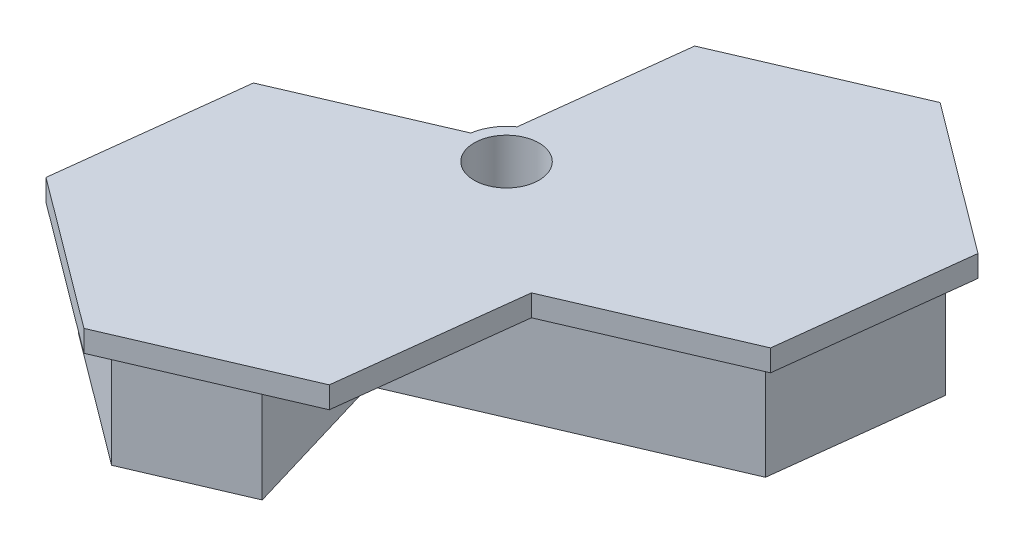
ISO-10303-21;
HEADER;
FILE_DESCRIPTION(('STEP AP214'),'2;1');
FILE_NAME('part.step','',(''),(''),'','','');
FILE_SCHEMA(('AUTOMOTIVE_DESIGN { 1 0 10303 214 1 1 1 1 }'));
ENDSEC;
DATA;
#1=APPLICATION_CONTEXT('core data for automotive mechanical design processes');
#2=APPLICATION_PROTOCOL_DEFINITION('international standard','automotive_design',2000,#1);
#3=PRODUCT_CONTEXT('',#1,'mechanical');
#4=PRODUCT('Part','Part','',(#3));
#5=PRODUCT_RELATED_PRODUCT_CATEGORY('part','',(#4));
#6=PRODUCT_DEFINITION_FORMATION('','',#4);
#7=PRODUCT_DEFINITION_CONTEXT('part definition',#1,'design');
#8=PRODUCT_DEFINITION('design','',#6,#7);
#9=PRODUCT_DEFINITION_SHAPE('','',#8);
#10=(LENGTH_UNIT() NAMED_UNIT(*) SI_UNIT(.MILLI.,.METRE.));
#11=(NAMED_UNIT(*) PLANE_ANGLE_UNIT() SI_UNIT($,.RADIAN.));
#12=(NAMED_UNIT(*) SI_UNIT($,.STERADIAN.) SOLID_ANGLE_UNIT());
#13=UNCERTAINTY_MEASURE_WITH_UNIT(LENGTH_MEASURE(1.E-05),#10,'distance_accuracy_value','');
#14=(GEOMETRIC_REPRESENTATION_CONTEXT(3) GLOBAL_UNCERTAINTY_ASSIGNED_CONTEXT((#13)) GLOBAL_UNIT_ASSIGNED_CONTEXT((#10,
#11,#12)) REPRESENTATION_CONTEXT('',''));
#15=CARTESIAN_POINT('',(0.,0.,0.));
#16=DIRECTION('',(0.,0.,1.));
#17=DIRECTION('',(1.,0.,0.));
#18=AXIS2_PLACEMENT_3D('',#15,#16,#17);
#19=CARTESIAN_POINT('',(2.2840636013441,6.,0.270294542721462));
#20=DIRECTION('',(-0.993070598364596,0.,-0.117519303366653));
#21=DIRECTION('',(-0.117519303366653,0.,0.993070598364596));
#22=AXIS2_PLACEMENT_3D('',#19,#20,#21);
#23=PLANE('',#22);
#24=DIRECTION('',(0.,-1.,0.));
#25=VECTOR('',#24,1.);
#26=CARTESIAN_POINT('',(2.34695539827269,6.,-0.261158525998961));
#27=LINE('',#26,#25);
#28=CARTESIAN_POINT('',(2.34695539827269,5.,-0.261158525998961));
#29=VERTEX_POINT('',#28);
#30=CARTESIAN_POINT('',(2.34695539827269,0.,-0.261158525998961));
#31=VERTEX_POINT('',#30);
#32=EDGE_CURVE('E44',#29,#31,#27,.T.);
#33=ORIENTED_EDGE('',*,*,#32,.F.);
#34=DIRECTION('',(0.117519303366653,0.,-0.993070598364596));
#35=VECTOR('',#34,1.);
#36=CARTESIAN_POINT('',(2.2840636013441,5.,0.270294542721462));
#37=LINE('',#36,#35);
#38=CARTESIAN_POINT('',(3.09303346210969,5.,-6.56572439778366));
#39=VERTEX_POINT('',#38);
#40=EDGE_CURVE('E296',#29,#39,#37,.T.);
#41=ORIENTED_EDGE('',*,*,#40,.T.);
#42=DIRECTION('',(0.,-1.,0.));
#43=VECTOR('',#42,1.);
#44=CARTESIAN_POINT('',(3.09303346210969,6.,-6.56572439778366));
#45=LINE('',#44,#43);
#46=CARTESIAN_POINT('',(3.09303346210969,0.,-6.56572439778366));
#47=VERTEX_POINT('',#46);
#48=EDGE_CURVE('E305',#39,#47,#45,.T.);
#49=ORIENTED_EDGE('',*,*,#48,.T.);
#50=DIRECTION('',(0.117519303366653,0.,-0.993070598364596));
#51=VECTOR('',#50,1.);
#52=CARTESIAN_POINT('',(2.2840636013441,0.,0.270294542721462));
#53=LINE('',#52,#51);
#54=EDGE_CURVE('E309',#31,#47,#53,.T.);
#55=ORIENTED_EDGE('',*,*,#54,.F.);
#56=EDGE_LOOP('',(#33,#41,#49,#55));
#57=FACE_BOUND('',#56,.T.);
#58=ADVANCED_FACE('F36',(#57),#23,.T.);
#59=CARTESIAN_POINT('',(0.983687521033545,6.,2.2894796984607));
#60=DIRECTION('',(0.394760597031727,0.,0.918784017618479));
#61=DIRECTION('',(0.918784017618479,0.,-0.394760597031727));
#62=AXIS2_PLACEMENT_3D('',#59,#60,#61);
#63=PLANE('',#62);
#64=DIRECTION('',(-0.918784017618479,0.,0.394760597031727));
#65=VECTOR('',#64,1.);
#66=CARTESIAN_POINT('',(0.983687521033545,5.,2.2894796984607));
#67=LINE('',#66,#65);
#68=CARTESIAN_POINT('',(0.58115921458738,5.,2.46242819509077));
#69=VERTEX_POINT('',#68);
#70=CARTESIAN_POINT('',(-5.64628129069239,5.,5.13808219505469));
#71=VERTEX_POINT('',#70);
#72=EDGE_CURVE('E292',#69,#71,#67,.T.);
#73=ORIENTED_EDGE('',*,*,#72,.F.);
#74=DIRECTION('',(0.,-1.,0.));
#75=VECTOR('',#74,1.);
#76=CARTESIAN_POINT('',(0.58115921458738,6.,2.46242819509077));
#77=LINE('',#76,#75);
#78=CARTESIAN_POINT('',(0.58115921458738,0.,2.46242819509077));
#79=VERTEX_POINT('',#78);
#80=EDGE_CURVE('E358',#69,#79,#77,.T.);
#81=ORIENTED_EDGE('',*,*,#80,.T.);
#82=DIRECTION('',(-0.918784017618479,0.,0.394760597031727));
#83=VECTOR('',#82,1.);
#84=CARTESIAN_POINT('',(0.983687521033545,0.,2.2894796984607));
#85=LINE('',#84,#83);
#86=CARTESIAN_POINT('',(-5.64628129069239,0.,5.13808219505469));
#87=VERTEX_POINT('',#86);
#88=EDGE_CURVE('E315',#79,#87,#85,.T.);
#89=ORIENTED_EDGE('',*,*,#88,.T.);
#90=DIRECTION('',(0.,-1.,0.));
#91=VECTOR('',#90,1.);
#92=CARTESIAN_POINT('',(-5.64628129069239,6.,5.13808219505469));
#93=LINE('',#92,#91);
#94=EDGE_CURVE('E356',#71,#87,#93,.T.);
#95=ORIENTED_EDGE('',*,*,#94,.F.);
#96=EDGE_LOOP('',(#73,#81,#89,#95));
#97=FACE_BOUND('',#96,.T.);
#98=ADVANCED_FACE('F407',(#97),#63,.F.);
#99=CARTESIAN_POINT('',(-4.9686620020453,6.,-0.587988102866323));
#100=DIRECTION('',(0.993070598364596,0.,0.117519303366653));
#101=DIRECTION('',(0.117519303366653,0.,-0.993070598364596));
#102=AXIS2_PLACEMENT_3D('',#99,#100,#101);
#103=PLANE('',#102);
#104=DIRECTION('',(-0.117519303366653,0.,0.993070598364596));
#105=VECTOR('',#104,1.);
#106=CARTESIAN_POINT('',(-4.9686620020453,5.,-0.587988102866323));
#107=LINE('',#106,#105);
#108=CARTESIAN_POINT('',(-6.52767606594229,5.,12.5861116827892));
#109=VERTEX_POINT('',#108);
#110=EDGE_CURVE('E289',#71,#109,#107,.T.);
#111=ORIENTED_EDGE('',*,*,#110,.F.);
#112=ORIENTED_EDGE('',*,*,#94,.T.);
#113=DIRECTION('',(-0.117519303366653,0.,0.993070598364596));
#114=VECTOR('',#113,1.);
#115=CARTESIAN_POINT('',(-4.9686620020453,0.,-0.587988102866323));
#116=LINE('',#115,#114);
#117=CARTESIAN_POINT('',(-6.52767606594229,0.,12.5861116827892));
#118=VERTEX_POINT('',#117);
#119=EDGE_CURVE('E318',#87,#118,#116,.T.);
#120=ORIENTED_EDGE('',*,*,#119,.T.);
#121=DIRECTION('',(0.,-1.,0.));
#122=VECTOR('',#121,1.);
#123=CARTESIAN_POINT('',(-6.52767606594229,6.,12.5861116827892));
#124=LINE('',#123,#122);
#125=EDGE_CURVE('E354',#109,#118,#124,.T.);
#126=ORIENTED_EDGE('',*,*,#125,.F.);
#127=EDGE_LOOP('',(#111,#112,#120,#126));
#128=FACE_BOUND('',#127,.T.);
#129=ADVANCED_FACE('F403',(#128),#103,.F.);
#130=CARTESIAN_POINT('',(-8.37058490872109,6.,11.2099986797239));
#131=DIRECTION('',(0.598310001332869,0.,-0.801264714251827));
#132=DIRECTION('',(-0.801264714251827,0.,-0.598310001332869));
#133=AXIS2_PLACEMENT_3D('',#130,#131,#132);
#134=PLANE('',#133);
#135=DIRECTION('',(0.801264714251827,0.,0.598310001332869));
#136=VECTOR('',#135,1.);
#137=CARTESIAN_POINT('',(-8.37058490872109,5.,11.2099986797239));
#138=LINE('',#137,#136);
#139=CARTESIAN_POINT('',(-0.518190709053594,5.,17.0734366927857));
#140=VERTEX_POINT('',#139);
#141=EDGE_CURVE('E286',#109,#140,#138,.T.);
#142=ORIENTED_EDGE('',*,*,#141,.F.);
#143=ORIENTED_EDGE('',*,*,#125,.T.);
#144=DIRECTION('',(0.801264714251827,0.,0.598310001332869));
#145=VECTOR('',#144,1.);
#146=CARTESIAN_POINT('',(-8.37058490872109,0.,11.2099986797239));
#147=LINE('',#146,#145);
#148=CARTESIAN_POINT('',(-0.518190709053594,0.,17.0734366927857));
#149=VERTEX_POINT('',#148);
#150=EDGE_CURVE('E321',#118,#149,#147,.T.);
#151=ORIENTED_EDGE('',*,*,#150,.T.);
#152=DIRECTION('',(0.,-1.,0.));
#153=VECTOR('',#152,1.);
#154=CARTESIAN_POINT('',(-0.518190709053594,6.,17.0734366927857));
#155=LINE('',#154,#153);
#156=EDGE_CURVE('E352',#140,#149,#155,.T.);
#157=ORIENTED_EDGE('',*,*,#156,.F.);
#158=EDGE_LOOP('',(#142,#143,#151,#157));
#159=FACE_BOUND('',#158,.T.);
#160=ADVANCED_FACE('F400',(#159),#134,.F.);
#161=CARTESIAN_POINT('',(6.11177810267236,6.,14.2248341961917));
#162=DIRECTION('',(-0.394760597031727,0.,-0.918784017618479));
#163=DIRECTION('',(-0.918784017618479,0.,0.394760597031727));
#164=AXIS2_PLACEMENT_3D('',#161,#162,#163);
#165=PLANE('',#164);
#166=DIRECTION('',(0.918784017618479,0.,-0.394760597031727));
#167=VECTOR('',#166,1.);
#168=CARTESIAN_POINT('',(6.11177810267236,5.,14.2248341961917));
#169=LINE('',#168,#167);
#170=CARTESIAN_POINT('',(4.36403892413723,5.,14.9757599288384));
#171=VERTEX_POINT('',#170);
#172=EDGE_CURVE('E283',#140,#171,#169,.T.);
#173=ORIENTED_EDGE('',*,*,#172,.F.);
#174=ORIENTED_EDGE('',*,*,#156,.T.);
#175=DIRECTION('',(0.918784017618479,0.,-0.394760597031727));
#176=VECTOR('',#175,1.);
#177=CARTESIAN_POINT('',(6.11177810267236,0.,14.2248341961917));
#178=LINE('',#177,#176);
#179=CARTESIAN_POINT('',(4.36403892413723,0.,14.9757599288384));
#180=VERTEX_POINT('',#179);
#181=EDGE_CURVE('E324',#149,#180,#178,.T.);
#182=ORIENTED_EDGE('',*,*,#181,.T.);
#183=DIRECTION('',(0.,-1.,0.));
#184=VECTOR('',#183,1.);
#185=CARTESIAN_POINT('',(4.36403892413723,6.,14.9757599288384));
#186=LINE('',#185,#184);
#187=EDGE_CURVE('E350',#171,#180,#186,.T.);
#188=ORIENTED_EDGE('',*,*,#187,.F.);
#189=EDGE_LOOP('',(#173,#174,#182,#188));
#190=FACE_BOUND('',#189,.T.);
#191=ADVANCED_FACE('F396',(#190),#165,.F.);
#192=CARTESIAN_POINT('',(-0.0979761705481806,6.,0.0292490438249233));
#193=DIRECTION('',(0.958212510773948,0.,-0.286057309286595));
#194=DIRECTION('',(-0.286057309286595,0.,-0.958212510773948));
#195=AXIS2_PLACEMENT_3D('',#192,#193,#194);
#196=PLANE('',#195);
#197=DIRECTION('',(0.,-1.,0.));
#198=VECTOR('',#197,1.);
#199=CARTESIAN_POINT('',(2.26080586597186,6.,7.93051352547426));
#200=LINE('',#199,#198);
#201=CARTESIAN_POINT('',(2.26080586597186,5.,7.93051352547426));
#202=VERTEX_POINT('',#201);
#203=CARTESIAN_POINT('',(2.26080586597186,0.,7.93051352547426));
#204=VERTEX_POINT('',#203);
#205=EDGE_CURVE('E348',#202,#204,#200,.T.);
#206=ORIENTED_EDGE('',*,*,#205,.F.);
#207=DIRECTION('',(0.286057309286595,0.,0.958212510773948));
#208=VECTOR('',#207,1.);
#209=CARTESIAN_POINT('',(-0.0979761705481806,5.,0.0292490438249233));
#210=LINE('',#209,#208);
#211=EDGE_CURVE('E281',#202,#171,#210,.T.);
#212=ORIENTED_EDGE('',*,*,#211,.T.);
#213=ORIENTED_EDGE('',*,*,#187,.T.);
#214=DIRECTION('',(0.286057309286595,0.,0.958212510773948));
#215=VECTOR('',#214,1.);
#216=CARTESIAN_POINT('',(-0.0979761705481806,0.,0.0292490438249233));
#217=LINE('',#216,#215);
#218=EDGE_CURVE('E327',#204,#180,#217,.T.);
#219=ORIENTED_EDGE('',*,*,#218,.F.);
#220=EDGE_LOOP('',(#206,#212,#213,#219));
#221=FACE_BOUND('',#220,.T.);
#222=ADVANCED_FACE('F393',(#221),#196,.T.);
#223=CARTESIAN_POINT('',(3.22870987568401,6.,7.51464825418475));
#224=DIRECTION('',(0.394760597031729,0.,0.918784017618478));
#225=DIRECTION('',(0.918784017618479,0.,-0.394760597031729));
#226=AXIS2_PLACEMENT_3D('',#223,#224,#225);
#227=PLANE('',#226);
#228=DIRECTION('',(0.,-1.,0.));
#229=VECTOR('',#228,1.);
#230=CARTESIAN_POINT('',(15.1120041758871,6.,2.40892562220939));
#231=LINE('',#230,#229);
#232=CARTESIAN_POINT('',(15.1120041758871,5.,2.40892562220939));
#233=VERTEX_POINT('',#232);
#234=CARTESIAN_POINT('',(15.1120041758871,0.,2.40892562220939));
#235=VERTEX_POINT('',#234);
#236=EDGE_CURVE('E346',#233,#235,#231,.T.);
#237=ORIENTED_EDGE('',*,*,#236,.F.);
#238=DIRECTION('',(-0.918784017618479,0.,0.394760597031729));
#239=VECTOR('',#238,1.);
#240=CARTESIAN_POINT('',(3.22870987568401,5.,7.51464825418475));
#241=LINE('',#240,#239);
#242=EDGE_CURVE('E279',#233,#202,#241,.T.);
#243=ORIENTED_EDGE('',*,*,#242,.T.);
#244=ORIENTED_EDGE('',*,*,#205,.T.);
#245=DIRECTION('',(-0.918784017618479,0.,0.394760597031729));
#246=VECTOR('',#245,1.);
#247=CARTESIAN_POINT('',(3.22870987568401,0.,7.51464825418475));
#248=LINE('',#247,#246);
#249=EDGE_CURVE('E330',#235,#204,#248,.T.);
#250=ORIENTED_EDGE('',*,*,#249,.F.);
#251=EDGE_LOOP('',(#237,#243,#244,#250));
#252=FACE_BOUND('',#251,.T.);
#253=ADVANCED_FACE('F389',(#252),#227,.T.);
#254=CARTESIAN_POINT('',(15.1844290903714,6.,1.79691507498004));
#255=DIRECTION('',(0.993070598364596,0.,0.117519303366653));
#256=DIRECTION('',(0.117519303366653,0.,-0.993070598364596));
#257=AXIS2_PLACEMENT_3D('',#254,#255,#256);
#258=PLANE('',#257);
#259=DIRECTION('',(0.,-1.,0.));
#260=VECTOR('',#259,1.);
#261=CARTESIAN_POINT('',(15.993398951137,6.,-5.03910386552505));
#262=LINE('',#261,#260);
#263=CARTESIAN_POINT('',(15.993398951137,5.,-5.03910386552505));
#264=VERTEX_POINT('',#263);
#265=CARTESIAN_POINT('',(15.993398951137,0.,-5.03910386552505));
#266=VERTEX_POINT('',#265);
#267=EDGE_CURVE('E344',#264,#266,#262,.T.);
#268=ORIENTED_EDGE('',*,*,#267,.F.);
#269=DIRECTION('',(-0.117519303366653,0.,0.993070598364596));
#270=VECTOR('',#269,1.);
#271=CARTESIAN_POINT('',(15.1844290903714,5.,1.79691507498004));
#272=LINE('',#271,#270);
#273=EDGE_CURVE('E277',#264,#233,#272,.T.);
#274=ORIENTED_EDGE('',*,*,#273,.T.);
#275=ORIENTED_EDGE('',*,*,#236,.T.);
#276=DIRECTION('',(-0.117519303366653,0.,0.993070598364596));
#277=VECTOR('',#276,1.);
#278=CARTESIAN_POINT('',(15.1844290903714,0.,1.79691507498004));
#279=LINE('',#278,#277);
#280=EDGE_CURVE('E333',#266,#235,#279,.T.);
#281=ORIENTED_EDGE('',*,*,#280,.F.);
#282=EDGE_LOOP('',(#268,#274,#275,#281));
#283=FACE_BOUND('',#282,.T.);
#284=ADVANCED_FACE('F383',(#283),#258,.T.);
#285=CARTESIAN_POINT('',(8.1410047514695,6.,-10.9025418785869));
#286=DIRECTION('',(0.598310001332869,0.,-0.801264714251827));
#287=DIRECTION('',(-0.801264714251827,0.,-0.598310001332869));
#288=AXIS2_PLACEMENT_3D('',#285,#286,#287);
#289=PLANE('',#288);
#290=DIRECTION('',(0.,-1.,0.));
#291=VECTOR('',#290,1.);
#292=CARTESIAN_POINT('',(9.98391359424826,6.,-9.52642887552159));
#293=LINE('',#292,#291);
#294=CARTESIAN_POINT('',(9.98391359424826,5.,-9.52642887552159));
#295=VERTEX_POINT('',#294);
#296=CARTESIAN_POINT('',(9.98391359424826,0.,-9.52642887552159));
#297=VERTEX_POINT('',#296);
#298=EDGE_CURVE('E342',#295,#297,#293,.T.);
#299=ORIENTED_EDGE('',*,*,#298,.F.);
#300=DIRECTION('',(0.801264714251827,0.,0.598310001332869));
#301=VECTOR('',#300,1.);
#302=CARTESIAN_POINT('',(8.1410047514695,5.,-10.9025418785869));
#303=LINE('',#302,#301);
#304=EDGE_CURVE('E275',#295,#264,#303,.T.);
#305=ORIENTED_EDGE('',*,*,#304,.T.);
#306=ORIENTED_EDGE('',*,*,#267,.T.);
#307=DIRECTION('',(0.801264714251827,0.,0.598310001332869));
#308=VECTOR('',#307,1.);
#309=CARTESIAN_POINT('',(8.1410047514695,0.,-10.9025418785869));
#310=LINE('',#309,#308);
#311=EDGE_CURVE('E336',#297,#266,#310,.T.);
#312=ORIENTED_EDGE('',*,*,#311,.F.);
#313=EDGE_LOOP('',(#299,#305,#306,#312));
#314=FACE_BOUND('',#313,.T.);
#315=ADVANCED_FACE('F379',(#314),#289,.T.);
#316=CARTESIAN_POINT('',(-1.89938070595483,6.,-4.42070624354627));
#317=DIRECTION('',(-0.394760597031726,0.,-0.91878401761848));
#318=DIRECTION('',(-0.91878401761848,0.,0.394760597031726));
#319=AXIS2_PLACEMENT_3D('',#316,#317,#318);
#320=PLANE('',#319);
#321=ORIENTED_EDGE('',*,*,#48,.F.);
#322=DIRECTION('',(0.91878401761848,0.,-0.394760597031726));
#323=VECTOR('',#322,1.);
#324=CARTESIAN_POINT('',(-1.89938070595483,5.,-4.42070624354627));
#325=LINE('',#324,#323);
#326=EDGE_CURVE('E11',#39,#295,#325,.T.);
#327=ORIENTED_EDGE('',*,*,#326,.T.);
#328=ORIENTED_EDGE('',*,*,#298,.T.);
#329=DIRECTION('',(0.91878401761848,0.,-0.394760597031726));
#330=VECTOR('',#329,1.);
#331=CARTESIAN_POINT('',(-1.89938070595483,0.,-4.42070624354627));
#332=LINE('',#331,#330);
#333=EDGE_CURVE('E302',#47,#297,#332,.T.);
#334=ORIENTED_EDGE('',*,*,#333,.F.);
#335=EDGE_LOOP('',(#321,#327,#328,#334));
#336=FACE_BOUND('',#335,.T.);
#337=ADVANCED_FACE('F372',(#336),#320,.T.);
#338=CARTESIAN_POINT('',(2.44474571745982,6.,1.73644930675332));
#339=DIRECTION('',(0.,-1.,0.));
#340=DIRECTION('',(0.,0.,-1.));
#341=AXIS2_PLACEMENT_3D('',#338,#339,#340);
#342=CYLINDRICAL_SURFACE('',#341,2.);
#343=CARTESIAN_POINT('',(2.44474571745982,5.,1.73644930675332));
#344=DIRECTION('',(0.,1.,0.));
#345=DIRECTION('',(0.,0.,1.));
#346=AXIS2_PLACEMENT_3D('',#343,#344,#345);
#347=CIRCLE('',#346,2.);
#348=CARTESIAN_POINT('',(0.469627415833889,5.,1.42195336944681));
#349=VERTEX_POINT('',#348);
#350=EDGE_CURVE('E51',#349,#69,#347,.T.);
#351=ORIENTED_EDGE('',*,*,#350,.F.);
#352=DIRECTION('',(0.,-1.,0.));
#353=VECTOR('',#352,1.);
#354=CARTESIAN_POINT('',(0.469627415833889,6.,1.42195336944681));
#355=LINE('',#354,#353);
#356=CARTESIAN_POINT('',(0.469627415833889,6.,1.42195336944681));
#357=VERTEX_POINT('',#356);
#358=EDGE_CURVE('E273',#349,#357,#355,.F.);
#359=ORIENTED_EDGE('',*,*,#358,.T.);
#360=CARTESIAN_POINT('',(2.44474571745982,6.,1.73644930675332));
#361=DIRECTION('',(0.,1.,0.));
#362=DIRECTION('',(0.,0.,1.));
#363=AXIS2_PLACEMENT_3D('',#360,#361,#362);
#364=CIRCLE('',#363,2.);
#365=CARTESIAN_POINT('',(1.29744568786728,6.,0.0982482683892986));
#366=VERTEX_POINT('',#365);
#367=EDGE_CURVE('E301',#366,#357,#364,.T.);
#368=ORIENTED_EDGE('',*,*,#367,.F.);
#369=DIRECTION('',(0.,-1.,0.));
#370=VECTOR('',#369,1.);
#371=CARTESIAN_POINT('',(1.29744568786728,6.,0.0982482683892991));
#372=LINE('',#371,#370);
#373=CARTESIAN_POINT('',(1.29744568786728,5.,0.0982482683892986));
#374=VERTEX_POINT('',#373);
#375=EDGE_CURVE('E58',#366,#374,#372,.T.);
#376=ORIENTED_EDGE('',*,*,#375,.T.);
#377=EDGE_CURVE('E204',#29,#374,#347,.T.);
#378=ORIENTED_EDGE('',*,*,#377,.F.);
#379=ORIENTED_EDGE('',*,*,#32,.T.);
#380=CARTESIAN_POINT('',(2.44474571745982,0.,1.73644930675332));
#381=DIRECTION('',(0.,1.,0.));
#382=DIRECTION('',(0.,0.,1.));
#383=AXIS2_PLACEMENT_3D('',#380,#381,#382);
#384=CIRCLE('',#383,2.);
#385=EDGE_CURVE('E312',#31,#79,#384,.T.);
#386=ORIENTED_EDGE('',*,*,#385,.T.);
#387=ORIENTED_EDGE('',*,*,#80,.F.);
#388=EDGE_LOOP('',(#351,#359,#368,#376,#378,#379,#386,#387));
#389=FACE_BOUND('',#388,.T.);
#390=ADVANCED_FACE('F361',(#389),#342,.T.);
#391=CARTESIAN_POINT('',(2.44567584284861,6.,1.73884147400104));
#392=DIRECTION('',(0.,-1.,0.));
#393=DIRECTION('',(0.,0.,-1.));
#394=AXIS2_PLACEMENT_3D('',#391,#392,#393);
#395=CYLINDRICAL_SURFACE('',#394,1.5);
#396=CARTESIAN_POINT('',(2.44567584284861,6.,1.73884147400104));
#397=DIRECTION('',(0.,1.,0.));
#398=DIRECTION('',(0.,0.,1.));
#399=AXIS2_PLACEMENT_3D('',#396,#397,#398);
#400=CIRCLE('',#399,1.5);
#401=CARTESIAN_POINT('',(2.44567584284861,6.,3.23884147400104));
#402=VERTEX_POINT('',#401);
#403=EDGE_CURVE('E298',#402,#402,#400,.T.);
#404=ORIENTED_EDGE('',*,*,#403,.T.);
#405=EDGE_LOOP('',(#404));
#406=FACE_BOUND('',#405,.T.);
#407=CARTESIAN_POINT('',(2.44567584284861,0.,1.73884147400104));
#408=DIRECTION('',(0.,1.,0.));
#409=DIRECTION('',(0.,0.,1.));
#410=AXIS2_PLACEMENT_3D('',#407,#408,#409);
#411=CIRCLE('',#410,1.5);
#412=CARTESIAN_POINT('',(2.44567584284861,0.,3.23884147400104));
#413=VERTEX_POINT('',#412);
#414=EDGE_CURVE('E306',#413,#413,#411,.T.);
#415=ORIENTED_EDGE('',*,*,#414,.F.);
#416=EDGE_LOOP('',(#415));
#417=FACE_BOUND('',#416,.T.);
#418=ADVANCED_FACE('F38',(#406,#417),#395,.F.);
#419=CARTESIAN_POINT('',(0.,6.,0.));
#420=DIRECTION('',(0.,1.,0.));
#421=DIRECTION('',(0.,0.,1.));
#422=AXIS2_PLACEMENT_3D('',#419,#420,#421);
#423=PLANE('',#422);
#424=DIRECTION('',(-0.117519303366653,0.,0.993070598364596));
#425=VECTOR('',#424,1.);
#426=CARTESIAN_POINT('',(1.29099300297951,6.,0.152775239354809));
#427=LINE('',#426,#425);
#428=CARTESIAN_POINT('',(2.16781266517881,6.,-7.25659327844041));
#429=VERTEX_POINT('',#428);
#430=EDGE_CURVE('E189',#429,#366,#427,.T.);
#431=ORIENTED_EDGE('',*,*,#430,.T.);
#432=ORIENTED_EDGE('',*,*,#367,.T.);
#433=DIRECTION('',(-0.91878401761848,0.,0.394760597031727));
#434=VECTOR('',#433,1.);
#435=CARTESIAN_POINT('',(0.588926924001818,6.,1.37069568084222));
#436=LINE('',#435,#434);
#437=CARTESIAN_POINT('',(-6.57150208762327,6.,4.44721331439793));
#438=VERTEX_POINT('',#437);
#439=EDGE_CURVE('E238',#357,#438,#436,.T.);
#440=ORIENTED_EDGE('',*,*,#439,.T.);
#441=DIRECTION('',(-0.117519303366653,0.,0.993070598364596));
#442=VECTOR('',#441,1.);
#443=CARTESIAN_POINT('',(-5.96173260040989,6.,-0.705507406232976));
#444=LINE('',#443,#442);
#445=CARTESIAN_POINT('',(-7.5885964657406,6.,13.0419419567126));
#446=VERTEX_POINT('',#445);
#447=EDGE_CURVE('E240',#438,#446,#444,.T.);
#448=ORIENTED_EDGE('',*,*,#447,.T.);
#449=DIRECTION('',(0.801264714251827,0.,0.598310001332869));
#450=VECTOR('',#449,1.);
#451=CARTESIAN_POINT('',(-8.96889491005395,6.,12.0112633939757));
#452=LINE('',#451,#450);
#453=CARTESIAN_POINT('',(-0.653890311921002,6.,18.2201358473659));
#454=VERTEX_POINT('',#453);
#455=EDGE_CURVE('E243',#446,#454,#452,.T.);
#456=ORIENTED_EDGE('',*,*,#455,.T.);
#457=DIRECTION('',(0.918784017618479,0.,-0.394760597031727));
#458=VECTOR('',#457,1.);
#459=CARTESIAN_POINT('',(6.50653869970409,6.,15.1436182138102));
#460=LINE('',#459,#458);
#461=CARTESIAN_POINT('',(7.29791022001592,6.,14.8036010957045));
#462=VERTEX_POINT('',#461);
#463=EDGE_CURVE('E246',#454,#462,#460,.T.);
#464=ORIENTED_EDGE('',*,*,#463,.T.);
#465=DIRECTION('',(0.117519303366653,0.,-0.993070598364596));
#466=VECTOR('',#465,1.);
#467=CARTESIAN_POINT('',(8.92477408534663,6.,1.05615173275891));
#468=LINE('',#467,#466);
#469=CARTESIAN_POINT('',(8.28896965295772,6.,6.42887493675364));
#470=VERTEX_POINT('',#469);
#471=EDGE_CURVE('E249',#462,#470,#468,.T.);
#472=ORIENTED_EDGE('',*,*,#471,.T.);
#473=DIRECTION('',(0.91878401761848,0.,-0.394760597031727));
#474=VECTOR('',#473,1.);
#475=CARTESIAN_POINT('',(3.62347047271568,6.,8.43343227180315));
#476=LINE('',#475,#474);
#477=CARTESIAN_POINT('',(16.0372249728179,6.,3.0997945028661));
#478=VERTEX_POINT('',#477);
#479=EDGE_CURVE('E252',#470,#478,#476,.T.);
#480=ORIENTED_EDGE('',*,*,#479,.T.);
#481=DIRECTION('',(0.117519303366653,0.,-0.993070598364596));
#482=VECTOR('',#481,1.);
#483=CARTESIAN_POINT('',(16.1774996887359,6.,1.91443437834668));
#484=LINE('',#483,#482);
#485=CARTESIAN_POINT('',(17.0543193509352,6.,-5.49493413944854));
#486=VERTEX_POINT('',#485);
#487=EDGE_CURVE('E212',#478,#486,#484,.T.);
#488=ORIENTED_EDGE('',*,*,#487,.T.);
#489=DIRECTION('',(-0.801264714251827,0.,-0.598310001332869));
#490=VECTOR('',#489,1.);
#491=CARTESIAN_POINT('',(8.73931475280236,6.,-11.7038065928387));
#492=LINE('',#491,#490);
#493=CARTESIAN_POINT('',(10.1196131971157,6.,-10.6731280301018));
#494=VERTEX_POINT('',#493);
#495=EDGE_CURVE('E209',#486,#494,#492,.T.);
#496=ORIENTED_EDGE('',*,*,#495,.T.);
#497=DIRECTION('',(-0.91878401761848,0.,0.394760597031727));
#498=VECTOR('',#497,1.);
#499=CARTESIAN_POINT('',(-2.29414130298656,6.,-5.33949026116475));
#500=LINE('',#499,#498);
#501=EDGE_CURVE('E235',#494,#429,#500,.T.);
#502=ORIENTED_EDGE('',*,*,#501,.T.);
#503=EDGE_LOOP('',(#431,#432,#440,#448,#456,#464,#472,#480,#488,#496,#502));
#504=FACE_BOUND('',#503,.T.);
#505=ORIENTED_EDGE('',*,*,#403,.F.);
#506=EDGE_LOOP('',(#505));
#507=FACE_BOUND('',#506,.T.);
#508=ADVANCED_FACE('F422',(#504,#507),#423,.T.);
#509=CARTESIAN_POINT('',(0.,0.,0.));
#510=DIRECTION('',(0.,1.,0.));
#511=DIRECTION('',(0.,0.,1.));
#512=AXIS2_PLACEMENT_3D('',#509,#510,#511);
#513=PLANE('',#512);
#514=ORIENTED_EDGE('',*,*,#414,.T.);
#515=EDGE_LOOP('',(#514));
#516=FACE_BOUND('',#515,.T.);
#517=ORIENTED_EDGE('',*,*,#54,.T.);
#518=ORIENTED_EDGE('',*,*,#333,.T.);
#519=ORIENTED_EDGE('',*,*,#311,.T.);
#520=ORIENTED_EDGE('',*,*,#280,.T.);
#521=ORIENTED_EDGE('',*,*,#249,.T.);
#522=ORIENTED_EDGE('',*,*,#218,.T.);
#523=ORIENTED_EDGE('',*,*,#181,.F.);
#524=ORIENTED_EDGE('',*,*,#150,.F.);
#525=ORIENTED_EDGE('',*,*,#119,.F.);
#526=ORIENTED_EDGE('',*,*,#88,.F.);
#527=ORIENTED_EDGE('',*,*,#385,.F.);
#528=EDGE_LOOP('',(#517,#518,#519,#520,#521,#522,#523,#524,#525,#526,#527));
#529=FACE_BOUND('',#528,.T.);
#530=ADVANCED_FACE('F366',(#516,#529),#513,.F.);
#531=CARTESIAN_POINT('',(0.,5.,0.));
#532=DIRECTION('',(0.,1.,0.));
#533=DIRECTION('',(0.,0.,1.));
#534=AXIS2_PLACEMENT_3D('',#531,#532,#533);
#535=PLANE('',#534);
#536=ORIENTED_EDGE('',*,*,#40,.F.);
#537=ORIENTED_EDGE('',*,*,#377,.T.);
#538=DIRECTION('',(-0.117519303366653,0.,0.993070598364596));
#539=VECTOR('',#538,1.);
#540=CARTESIAN_POINT('',(1.29099300297951,5.,0.152775239354809));
#541=LINE('',#540,#539);
#542=CARTESIAN_POINT('',(2.16781266517881,5.,-7.25659327844041));
#543=VERTEX_POINT('',#542);
#544=EDGE_CURVE('E187',#543,#374,#541,.T.);
#545=ORIENTED_EDGE('',*,*,#544,.F.);
#546=DIRECTION('',(-0.91878401761848,0.,0.394760597031727));
#547=VECTOR('',#546,1.);
#548=CARTESIAN_POINT('',(-2.29414130298656,5.,-5.33949026116475));
#549=LINE('',#548,#547);
#550=CARTESIAN_POINT('',(10.1196131971157,5.,-10.6731280301018));
#551=VERTEX_POINT('',#550);
#552=EDGE_CURVE('E202',#551,#543,#549,.T.);
#553=ORIENTED_EDGE('',*,*,#552,.F.);
#554=DIRECTION('',(-0.801264714251827,0.,-0.598310001332869));
#555=VECTOR('',#554,1.);
#556=CARTESIAN_POINT('',(8.73931475280236,5.,-11.7038065928387));
#557=LINE('',#556,#555);
#558=CARTESIAN_POINT('',(17.0543193509352,5.,-5.49493413944854));
#559=VERTEX_POINT('',#558);
#560=EDGE_CURVE('E195',#559,#551,#557,.T.);
#561=ORIENTED_EDGE('',*,*,#560,.F.);
#562=DIRECTION('',(0.117519303366653,0.,-0.993070598364596));
#563=VECTOR('',#562,1.);
#564=CARTESIAN_POINT('',(16.1774996887359,5.,1.91443437834668));
#565=LINE('',#564,#563);
#566=CARTESIAN_POINT('',(16.0372249728179,5.,3.0997945028661));
#567=VERTEX_POINT('',#566);
#568=EDGE_CURVE('E231',#567,#559,#565,.T.);
#569=ORIENTED_EDGE('',*,*,#568,.F.);
#570=DIRECTION('',(0.91878401761848,0.,-0.394760597031727));
#571=VECTOR('',#570,1.);
#572=CARTESIAN_POINT('',(3.62347047271568,5.,8.43343227180315));
#573=LINE('',#572,#571);
#574=CARTESIAN_POINT('',(8.28896965295772,5.,6.42887493675364));
#575=VERTEX_POINT('',#574);
#576=EDGE_CURVE('E228',#575,#567,#573,.T.);
#577=ORIENTED_EDGE('',*,*,#576,.F.);
#578=DIRECTION('',(0.117519303366653,0.,-0.993070598364596));
#579=VECTOR('',#578,1.);
#580=CARTESIAN_POINT('',(8.92477408534663,5.,1.05615173275891));
#581=LINE('',#580,#579);
#582=CARTESIAN_POINT('',(7.29791022001592,5.,14.8036010957045));
#583=VERTEX_POINT('',#582);
#584=EDGE_CURVE('E225',#583,#575,#581,.T.);
#585=ORIENTED_EDGE('',*,*,#584,.F.);
#586=DIRECTION('',(0.918784017618479,0.,-0.394760597031727));
#587=VECTOR('',#586,1.);
#588=CARTESIAN_POINT('',(6.50653869970409,5.,15.1436182138102));
#589=LINE('',#588,#587);
#590=CARTESIAN_POINT('',(-0.653890311921002,5.,18.2201358473659));
#591=VERTEX_POINT('',#590);
#592=EDGE_CURVE('E222',#591,#583,#589,.T.);
#593=ORIENTED_EDGE('',*,*,#592,.F.);
#594=DIRECTION('',(0.801264714251827,0.,0.598310001332869));
#595=VECTOR('',#594,1.);
#596=CARTESIAN_POINT('',(-8.96889491005395,5.,12.0112633939757));
#597=LINE('',#596,#595);
#598=CARTESIAN_POINT('',(-7.5885964657406,5.,13.0419419567126));
#599=VERTEX_POINT('',#598);
#600=EDGE_CURVE('E219',#599,#591,#597,.T.);
#601=ORIENTED_EDGE('',*,*,#600,.F.);
#602=DIRECTION('',(-0.117519303366653,0.,0.993070598364596));
#603=VECTOR('',#602,1.);
#604=CARTESIAN_POINT('',(-5.96173260040989,5.,-0.705507406232976));
#605=LINE('',#604,#603);
#606=CARTESIAN_POINT('',(-6.57150208762327,5.,4.44721331439793));
#607=VERTEX_POINT('',#606);
#608=EDGE_CURVE('E216',#607,#599,#605,.T.);
#609=ORIENTED_EDGE('',*,*,#608,.F.);
#610=DIRECTION('',(-0.91878401761848,0.,0.394760597031727));
#611=VECTOR('',#610,1.);
#612=CARTESIAN_POINT('',(0.588926924001818,5.,1.37069568084222));
#613=LINE('',#612,#611);
#614=EDGE_CURVE('E205',#349,#607,#613,.T.);
#615=ORIENTED_EDGE('',*,*,#614,.F.);
#616=ORIENTED_EDGE('',*,*,#350,.T.);
#617=ORIENTED_EDGE('',*,*,#72,.T.);
#618=ORIENTED_EDGE('',*,*,#110,.T.);
#619=ORIENTED_EDGE('',*,*,#141,.T.);
#620=ORIENTED_EDGE('',*,*,#172,.T.);
#621=ORIENTED_EDGE('',*,*,#211,.F.);
#622=ORIENTED_EDGE('',*,*,#242,.F.);
#623=ORIENTED_EDGE('',*,*,#273,.F.);
#624=ORIENTED_EDGE('',*,*,#304,.F.);
#625=ORIENTED_EDGE('',*,*,#326,.F.);
#626=EDGE_LOOP('',(#536,#537,#545,#553,#561,#569,#577,#585,#593,#601,#609,#615,#616,#617,#618,
#619,#620,#621,#622,#623,#624,#625));
#627=FACE_BOUND('',#626,.T.);
#628=ADVANCED_FACE('F200',(#627),#535,.F.);
#629=CARTESIAN_POINT('',(0.588926924001818,5.,1.37069568084222));
#630=DIRECTION('',(-0.394760597031727,0.,-0.91878401761848));
#631=DIRECTION('',(-0.91878401761848,0.,0.394760597031727));
#632=AXIS2_PLACEMENT_3D('',#629,#630,#631);
#633=PLANE('',#632);
#634=ORIENTED_EDGE('',*,*,#358,.F.);
#635=ORIENTED_EDGE('',*,*,#614,.T.);
#636=DIRECTION('',(0.,1.,0.));
#637=VECTOR('',#636,1.);
#638=CARTESIAN_POINT('',(-6.57150208762327,5.,4.44721331439793));
#639=LINE('',#638,#637);
#640=EDGE_CURVE('E194',#607,#438,#639,.T.);
#641=ORIENTED_EDGE('',*,*,#640,.T.);
#642=ORIENTED_EDGE('',*,*,#439,.F.);
#643=EDGE_LOOP('',(#634,#635,#641,#642));
#644=FACE_BOUND('',#643,.T.);
#645=ADVANCED_FACE('F500',(#644),#633,.T.);
#646=CARTESIAN_POINT('',(1.29099300297951,5.,0.152775239354809));
#647=DIRECTION('',(-0.993070598364596,0.,-0.117519303366653));
#648=DIRECTION('',(-0.117519303366653,0.,0.993070598364596));
#649=AXIS2_PLACEMENT_3D('',#646,#647,#648);
#650=PLANE('',#649);
#651=ORIENTED_EDGE('',*,*,#375,.F.);
#652=ORIENTED_EDGE('',*,*,#430,.F.);
#653=DIRECTION('',(0.,1.,0.));
#654=VECTOR('',#653,1.);
#655=CARTESIAN_POINT('',(2.16781266517881,5.,-7.25659327844041));
#656=LINE('',#655,#654);
#657=EDGE_CURVE('E184',#543,#429,#656,.T.);
#658=ORIENTED_EDGE('',*,*,#657,.F.);
#659=ORIENTED_EDGE('',*,*,#544,.T.);
#660=EDGE_LOOP('',(#651,#652,#658,#659));
#661=FACE_BOUND('',#660,.T.);
#662=ADVANCED_FACE('F186',(#661),#650,.T.);
#663=CARTESIAN_POINT('',(-2.29414130298656,5.,-5.33949026116475));
#664=DIRECTION('',(-0.394760597031727,0.,-0.91878401761848));
#665=DIRECTION('',(-0.91878401761848,0.,0.394760597031727));
#666=AXIS2_PLACEMENT_3D('',#663,#664,#665);
#667=PLANE('',#666);
#668=ORIENTED_EDGE('',*,*,#501,.F.);
#669=DIRECTION('',(0.,1.,0.));
#670=VECTOR('',#669,1.);
#671=CARTESIAN_POINT('',(10.1196131971157,5.,-10.6731280301018));
#672=LINE('',#671,#670);
#673=EDGE_CURVE('E208',#551,#494,#672,.T.);
#674=ORIENTED_EDGE('',*,*,#673,.F.);
#675=ORIENTED_EDGE('',*,*,#552,.T.);
#676=ORIENTED_EDGE('',*,*,#657,.T.);
#677=EDGE_LOOP('',(#668,#674,#675,#676));
#678=FACE_BOUND('',#677,.T.);
#679=ADVANCED_FACE('F207',(#678),#667,.T.);
#680=CARTESIAN_POINT('',(8.73931475280236,5.,-11.7038065928387));
#681=DIRECTION('',(0.598310001332869,0.,-0.801264714251827));
#682=DIRECTION('',(-0.801264714251827,0.,-0.598310001332869));
#683=AXIS2_PLACEMENT_3D('',#680,#681,#682);
#684=PLANE('',#683);
#685=ORIENTED_EDGE('',*,*,#495,.F.);
#686=DIRECTION('',(0.,1.,0.));
#687=VECTOR('',#686,1.);
#688=CARTESIAN_POINT('',(17.0543193509352,5.,-5.49493413944854));
#689=LINE('',#688,#687);
#690=EDGE_CURVE('E258',#559,#486,#689,.T.);
#691=ORIENTED_EDGE('',*,*,#690,.F.);
#692=ORIENTED_EDGE('',*,*,#560,.T.);
#693=ORIENTED_EDGE('',*,*,#673,.T.);
#694=EDGE_LOOP('',(#685,#691,#692,#693));
#695=FACE_BOUND('',#694,.T.);
#696=ADVANCED_FACE('F527',(#695),#684,.T.);
#697=CARTESIAN_POINT('',(16.1774996887359,5.,1.91443437834668));
#698=DIRECTION('',(0.993070598364596,0.,0.117519303366653));
#699=DIRECTION('',(0.117519303366653,0.,-0.993070598364596));
#700=AXIS2_PLACEMENT_3D('',#697,#698,#699);
#701=PLANE('',#700);
#702=ORIENTED_EDGE('',*,*,#487,.F.);
#703=DIRECTION('',(0.,1.,0.));
#704=VECTOR('',#703,1.);
#705=CARTESIAN_POINT('',(16.0372249728179,5.,3.0997945028661));
#706=LINE('',#705,#704);
#707=EDGE_CURVE('E260',#567,#478,#706,.T.);
#708=ORIENTED_EDGE('',*,*,#707,.F.);
#709=ORIENTED_EDGE('',*,*,#568,.T.);
#710=ORIENTED_EDGE('',*,*,#690,.T.);
#711=EDGE_LOOP('',(#702,#708,#709,#710));
#712=FACE_BOUND('',#711,.T.);
#713=ADVANCED_FACE('F536',(#712),#701,.T.);
#714=CARTESIAN_POINT('',(3.62347047271568,5.,8.43343227180315));
#715=DIRECTION('',(0.394760597031727,0.,0.91878401761848));
#716=DIRECTION('',(0.91878401761848,0.,-0.394760597031727));
#717=AXIS2_PLACEMENT_3D('',#714,#715,#716);
#718=PLANE('',#717);
#719=ORIENTED_EDGE('',*,*,#479,.F.);
#720=DIRECTION('',(0.,1.,0.));
#721=VECTOR('',#720,1.);
#722=CARTESIAN_POINT('',(8.28896965295772,5.,6.42887493675364));
#723=LINE('',#722,#721);
#724=EDGE_CURVE('E262',#575,#470,#723,.T.);
#725=ORIENTED_EDGE('',*,*,#724,.F.);
#726=ORIENTED_EDGE('',*,*,#576,.T.);
#727=ORIENTED_EDGE('',*,*,#707,.T.);
#728=EDGE_LOOP('',(#719,#725,#726,#727));
#729=FACE_BOUND('',#728,.T.);
#730=ADVANCED_FACE('F546',(#729),#718,.T.);
#731=CARTESIAN_POINT('',(8.92477408534663,5.,1.05615173275891));
#732=DIRECTION('',(0.993070598364596,0.,0.117519303366653));
#733=DIRECTION('',(0.117519303366653,0.,-0.993070598364596));
#734=AXIS2_PLACEMENT_3D('',#731,#732,#733);
#735=PLANE('',#734);
#736=ORIENTED_EDGE('',*,*,#471,.F.);
#737=DIRECTION('',(0.,1.,0.));
#738=VECTOR('',#737,1.);
#739=CARTESIAN_POINT('',(7.29791022001592,5.,14.8036010957045));
#740=LINE('',#739,#738);
#741=EDGE_CURVE('E264',#583,#462,#740,.T.);
#742=ORIENTED_EDGE('',*,*,#741,.F.);
#743=ORIENTED_EDGE('',*,*,#584,.T.);
#744=ORIENTED_EDGE('',*,*,#724,.T.);
#745=EDGE_LOOP('',(#736,#742,#743,#744));
#746=FACE_BOUND('',#745,.T.);
#747=ADVANCED_FACE('F556',(#746),#735,.T.);
#748=CARTESIAN_POINT('',(6.50653869970409,5.,15.1436182138102));
#749=DIRECTION('',(0.394760597031727,0.,0.91878401761848));
#750=DIRECTION('',(0.91878401761848,0.,-0.394760597031727));
#751=AXIS2_PLACEMENT_3D('',#748,#749,#750);
#752=PLANE('',#751);
#753=ORIENTED_EDGE('',*,*,#463,.F.);
#754=DIRECTION('',(0.,1.,0.));
#755=VECTOR('',#754,1.);
#756=CARTESIAN_POINT('',(-0.653890311921002,5.,18.2201358473659));
#757=LINE('',#756,#755);
#758=EDGE_CURVE('E266',#591,#454,#757,.T.);
#759=ORIENTED_EDGE('',*,*,#758,.F.);
#760=ORIENTED_EDGE('',*,*,#592,.T.);
#761=ORIENTED_EDGE('',*,*,#741,.T.);
#762=EDGE_LOOP('',(#753,#759,#760,#761));
#763=FACE_BOUND('',#762,.T.);
#764=ADVANCED_FACE('F566',(#763),#752,.T.);
#765=CARTESIAN_POINT('',(-8.96889491005395,5.,12.0112633939757));
#766=DIRECTION('',(-0.598310001332869,0.,0.801264714251827));
#767=DIRECTION('',(0.801264714251827,0.,0.598310001332869));
#768=AXIS2_PLACEMENT_3D('',#765,#766,#767);
#769=PLANE('',#768);
#770=ORIENTED_EDGE('',*,*,#455,.F.);
#771=DIRECTION('',(0.,1.,0.));
#772=VECTOR('',#771,1.);
#773=CARTESIAN_POINT('',(-7.5885964657406,5.,13.0419419567126));
#774=LINE('',#773,#772);
#775=EDGE_CURVE('E268',#599,#446,#774,.T.);
#776=ORIENTED_EDGE('',*,*,#775,.F.);
#777=ORIENTED_EDGE('',*,*,#600,.T.);
#778=ORIENTED_EDGE('',*,*,#758,.T.);
#779=EDGE_LOOP('',(#770,#776,#777,#778));
#780=FACE_BOUND('',#779,.T.);
#781=ADVANCED_FACE('F576',(#780),#769,.T.);
#782=CARTESIAN_POINT('',(-5.96173260040989,5.,-0.705507406232976));
#783=DIRECTION('',(-0.993070598364596,0.,-0.117519303366653));
#784=DIRECTION('',(-0.117519303366653,0.,0.993070598364596));
#785=AXIS2_PLACEMENT_3D('',#782,#783,#784);
#786=PLANE('',#785);
#787=ORIENTED_EDGE('',*,*,#447,.F.);
#788=ORIENTED_EDGE('',*,*,#640,.F.);
#789=ORIENTED_EDGE('',*,*,#608,.T.);
#790=ORIENTED_EDGE('',*,*,#775,.T.);
#791=EDGE_LOOP('',(#787,#788,#789,#790));
#792=FACE_BOUND('',#791,.T.);
#793=ADVANCED_FACE('F586',(#792),#786,.T.);
#794=CLOSED_SHELL('',(#58,#98,#129,#160,#191,#222,#253,#284,#315,#337,#390,#418,#508,#530,#628,
#645,#662,#679,#696,#713,#730,#747,#764,#781,#793));
#795=MANIFOLD_SOLID_BREP('B2',#794);
#796=ADVANCED_BREP_SHAPE_REPRESENTATION('',(#18,#795),#14);
#797=SHAPE_DEFINITION_REPRESENTATION(#9,#796);
ENDSEC;
END-ISO-10303-21;
